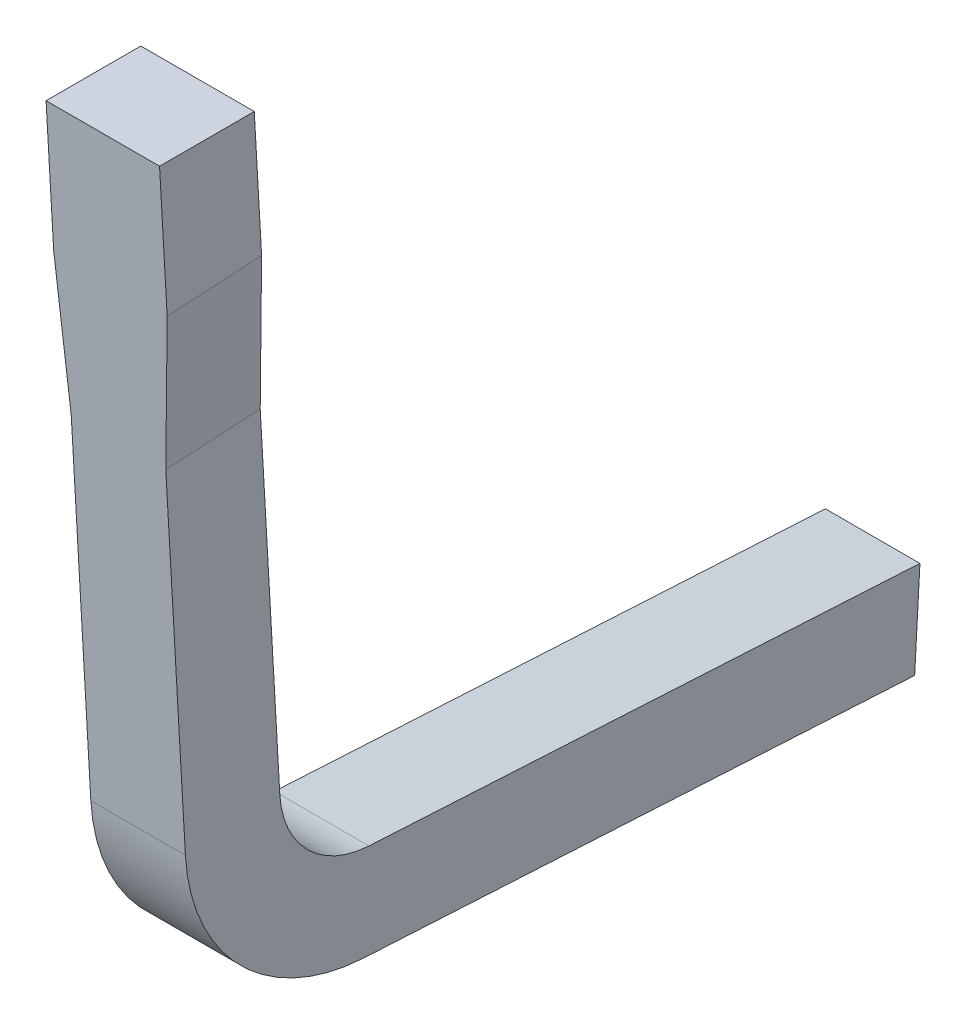
ISO-10303-21;
HEADER;
FILE_DESCRIPTION(('STEP AP214'),'2;1');
FILE_NAME('part.step','',(''),(''),'','','');
FILE_SCHEMA(('AUTOMOTIVE_DESIGN { 1 0 10303 214 1 1 1 1 }'));
ENDSEC;
DATA;
#1=APPLICATION_CONTEXT('core data for automotive mechanical design processes');
#2=APPLICATION_PROTOCOL_DEFINITION('international standard','automotive_design',2000,#1);
#3=PRODUCT_CONTEXT('',#1,'mechanical');
#4=PRODUCT('Part','Part','',(#3));
#5=PRODUCT_RELATED_PRODUCT_CATEGORY('part','',(#4));
#6=PRODUCT_DEFINITION_FORMATION('','',#4);
#7=PRODUCT_DEFINITION_CONTEXT('part definition',#1,'design');
#8=PRODUCT_DEFINITION('design','',#6,#7);
#9=PRODUCT_DEFINITION_SHAPE('','',#8);
#10=(LENGTH_UNIT() NAMED_UNIT(*) SI_UNIT(.MILLI.,.METRE.));
#11=(NAMED_UNIT(*) PLANE_ANGLE_UNIT() SI_UNIT($,.RADIAN.));
#12=(NAMED_UNIT(*) SI_UNIT($,.STERADIAN.) SOLID_ANGLE_UNIT());
#13=UNCERTAINTY_MEASURE_WITH_UNIT(LENGTH_MEASURE(1.E-05),#10,'distance_accuracy_value','');
#14=(GEOMETRIC_REPRESENTATION_CONTEXT(3) GLOBAL_UNCERTAINTY_ASSIGNED_CONTEXT((#13)) GLOBAL_UNIT_ASSIGNED_CONTEXT((#10,
#11,#12)) REPRESENTATION_CONTEXT('',''));
#15=CARTESIAN_POINT('',(0.,0.,0.));
#16=DIRECTION('',(0.,0.,1.));
#17=DIRECTION('',(1.,0.,0.));
#18=AXIS2_PLACEMENT_3D('',#15,#16,#17);
#19=CARTESIAN_POINT('',(0.88,-1.879082198882,-10.32387202233));
#20=DIRECTION('',(1.,0.,0.));
#21=DIRECTION('',(0.,0.,-1.));
#22=AXIS2_PLACEMENT_3D('',#19,#20,#21);
#23=PLANE('',#22);
#24=DIRECTION('',(1.7997756063594E-13,-0.0569406083160486,0.998377567418559));
#25=VECTOR('',#24,1.);
#26=CARTESIAN_POINT('',(0.879999999999996,-2.014836222708,-10.43177700759));
#27=LINE('',#26,#25);
#28=CARTESIAN_POINT('',(0.879999999999999,-2.01483622270796,-10.4317770075908));
#29=VERTEX_POINT('',#28);
#30=CARTESIAN_POINT('',(0.880000000000011,-2.02622434437119,-10.2321014941066));
#31=VERTEX_POINT('',#30);
#32=EDGE_CURVE('E183',#29,#31,#27,.T.);
#33=ORIENTED_EDGE('',*,*,#32,.T.);
#34=DIRECTION('',(0.,-0.998377567418999,-0.0569406083083299));
#35=VECTOR('',#34,1.);
#36=CARTESIAN_POINT('',(0.88,-2.398052209196,-10.25330800505));
#37=LINE('',#36,#35);
#38=CARTESIAN_POINT('',(0.88,-1.74332817505504,-10.2159670370689));
#39=VERTEX_POINT('',#38);
#40=EDGE_CURVE('E180',#39,#31,#37,.T.);
#41=ORIENTED_EDGE('',*,*,#40,.F.);
#42=DIRECTION('',(0.,0.,1.));
#43=VECTOR('',#42,1.);
#44=CARTESIAN_POINT('',(0.88,-1.743328175055,-10.31612954398));
#45=LINE('',#44,#43);
#46=CARTESIAN_POINT('',(0.88,-1.74332817505473,-10.4162920508947));
#47=VERTEX_POINT('',#46);
#48=EDGE_CURVE('E175',#47,#39,#45,.T.);
#49=ORIENTED_EDGE('',*,*,#48,.F.);
#50=DIRECTION('',(0.,-0.998377567418624,-0.0569406083148914));
#51=VECTOR('',#50,1.);
#52=CARTESIAN_POINT('',(0.88,-2.392358148368,-10.45330826871));
#53=LINE('',#52,#51);
#54=EDGE_CURVE('E205',#47,#29,#53,.T.);
#55=ORIENTED_EDGE('',*,*,#54,.T.);
#56=EDGE_LOOP('',(#33,#41,#49,#55));
#57=FACE_BOUND('',#56,.T.);
#58=ADVANCED_FACE('F17',(#57),#23,.F.);
#59=CARTESIAN_POINT('',(0.89,-2.170286918652,-10.3404803421));
#60=DIRECTION('',(0.997785157856611,0.0664110879137907,0.00378763292362404));
#61=DIRECTION('',(-0.0664115642910679,0.99779231512796,0.));
#62=AXIS2_PLACEMENT_3D('',#59,#60,#61);
#63=PLANE('',#62);
#64=DIRECTION('',(0.0665190105237393,-0.996166318707665,-0.0568144938493813));
#65=VECTOR('',#64,1.);
#66=CARTESIAN_POINT('',(0.88,-2.02622434437119,-10.2321014941066));
#67=LINE('',#66,#65);
#68=CARTESIAN_POINT('',(0.9,-2.32573761459706,-10.2491836765991));
#69=VERTEX_POINT('',#68);
#70=EDGE_CURVE('E161',#31,#69,#67,.T.);
#71=ORIENTED_EDGE('',*,*,#70,.F.);
#72=ORIENTED_EDGE('',*,*,#32,.F.);
#73=DIRECTION('',(0.0665190105237394,-0.996166318707292,-0.0568144938559241));
#74=VECTOR('',#73,1.);
#75=CARTESIAN_POINT('',(0.88,-2.01483622270793,-10.4317770075911));
#76=LINE('',#75,#74);
#77=CARTESIAN_POINT('',(0.9,-2.31434949293379,-10.4488591900838));
#78=VERTEX_POINT('',#77);
#79=EDGE_CURVE('E115',#29,#78,#76,.T.);
#80=ORIENTED_EDGE('',*,*,#79,.T.);
#81=DIRECTION('',(0.,-0.0569406083160594,0.998377567418558));
#82=VECTOR('',#81,1.);
#83=CARTESIAN_POINT('',(0.9,-2.314349492934,-10.44885919008));
#84=LINE('',#83,#82);
#85=EDGE_CURVE('E110',#78,#69,#84,.T.);
#86=ORIENTED_EDGE('',*,*,#85,.T.);
#87=EDGE_LOOP('',(#71,#72,#80,#86));
#88=FACE_BOUND('',#87,.T.);
#89=ADVANCED_FACE('F288',(#88),#63,.F.);
#90=CARTESIAN_POINT('',(1.12,-1.879082198882,-10.32387202233));
#91=DIRECTION('',(1.,0.,0.));
#92=DIRECTION('',(0.,0.,-1.));
#93=AXIS2_PLACEMENT_3D('',#90,#91,#92);
#94=PLANE('',#93);
#95=DIRECTION('',(0.,-0.998377567418624,-0.0569406083148914));
#96=VECTOR('',#95,1.);
#97=CARTESIAN_POINT('',(1.12,-2.392358148368,-10.45330826871));
#98=LINE('',#97,#96);
#99=CARTESIAN_POINT('',(1.12000000000002,-2.01483622270898,-10.4317770075904));
#100=VERTEX_POINT('',#99);
#101=CARTESIAN_POINT('',(1.12,-1.74332817505473,-10.4162920508947));
#102=VERTEX_POINT('',#101);
#103=EDGE_CURVE('E128',#100,#102,#98,.F.);
#104=ORIENTED_EDGE('',*,*,#103,.T.);
#105=DIRECTION('',(0.,0.,1.));
#106=VECTOR('',#105,1.);
#107=CARTESIAN_POINT('',(1.12,-1.743328175055,-10.31612954398));
#108=LINE('',#107,#106);
#109=CARTESIAN_POINT('',(1.12,-1.74332817505504,-10.2159670370692));
#110=VERTEX_POINT('',#109);
#111=EDGE_CURVE('E185',#110,#102,#108,.F.);
#112=ORIENTED_EDGE('',*,*,#111,.F.);
#113=DIRECTION('',(0.,-0.998377567418999,-0.0569406083083299));
#114=VECTOR('',#113,1.);
#115=CARTESIAN_POINT('',(1.12,-2.398052209196,-10.25330800505));
#116=LINE('',#115,#114);
#117=CARTESIAN_POINT('',(1.12000000000001,-2.02622434437119,-10.2321014941066));
#118=VERTEX_POINT('',#117);
#119=EDGE_CURVE('E168',#118,#110,#116,.F.);
#120=ORIENTED_EDGE('',*,*,#119,.F.);
#121=DIRECTION('',(0.,-0.0569406083110731,0.998377567418842));
#122=VECTOR('',#121,1.);
#123=CARTESIAN_POINT('',(1.12000000000003,-2.014836222709,-10.43177700759));
#124=LINE('',#123,#122);
#125=EDGE_CURVE('E131',#100,#118,#124,.T.);
#126=ORIENTED_EDGE('',*,*,#125,.F.);
#127=EDGE_LOOP('',(#104,#112,#120,#126));
#128=FACE_BOUND('',#127,.T.);
#129=ADVANCED_FACE('F251',(#128),#94,.T.);
#130=CARTESIAN_POINT('',(1.,-1.743328175055,-10.31612954398));
#131=DIRECTION('',(0.,1.,0.));
#132=DIRECTION('',(0.,0.,1.));
#133=AXIS2_PLACEMENT_3D('',#130,#131,#132);
#134=PLANE('',#133);
#135=DIRECTION('',(1.,0.,0.));
#136=VECTOR('',#135,1.);
#137=CARTESIAN_POINT('',(1.,-1.74332817505459,-10.4162920508971));
#138=LINE('',#137,#136);
#139=EDGE_CURVE('E138',#102,#47,#138,.F.);
#140=ORIENTED_EDGE('',*,*,#139,.T.);
#141=ORIENTED_EDGE('',*,*,#48,.T.);
#142=DIRECTION('',(1.,0.,0.));
#143=VECTOR('',#142,1.);
#144=CARTESIAN_POINT('',(1.,-1.74332817505506,-10.2159670370689));
#145=LINE('',#144,#143);
#146=EDGE_CURVE('E171',#110,#39,#145,.F.);
#147=ORIENTED_EDGE('',*,*,#146,.F.);
#148=ORIENTED_EDGE('',*,*,#111,.T.);
#149=EDGE_LOOP('',(#140,#141,#147,#148));
#150=FACE_BOUND('',#149,.T.);
#151=ADVANCED_FACE('F291',(#150),#134,.T.);
#152=CARTESIAN_POINT('',(0.9,-2.898875732105,-11.04167004462));
#153=DIRECTION('',(1.,0.,0.));
#154=DIRECTION('',(0.,0.,-1.));
#155=AXIS2_PLACEMENT_3D('',#152,#153,#154);
#156=PLANE('',#155);
#157=CARTESIAN_POINT('',(0.9,-3.03,-10.69));
#158=DIRECTION('',(-1.,0.,0.));
#159=DIRECTION('',(0.,0.,1.));
#160=AXIS2_PLACEMENT_3D('',#157,#158,#159);
#161=CIRCLE('',#160,0.4);
#162=CARTESIAN_POINT('',(0.9,-3.05277624332116,-10.2906489730313));
#163=VERTEX_POINT('',#162);
#164=CARTESIAN_POINT('',(0.9,-3.42937693582933,-10.6676826720305));
#165=VERTEX_POINT('',#164);
#166=EDGE_CURVE('E155',#163,#165,#161,.F.);
#167=ORIENTED_EDGE('',*,*,#166,.F.);
#168=DIRECTION('',(0.,-0.998377567418999,-0.0569406083083299));
#169=VECTOR('',#168,1.);
#170=CARTESIAN_POINT('',(0.9,-2.398052209196,-10.25330800505));
#171=LINE('',#170,#169);
#172=EDGE_CURVE('E158',#69,#163,#171,.T.);
#173=ORIENTED_EDGE('',*,*,#172,.F.);
#174=ORIENTED_EDGE('',*,*,#85,.F.);
#175=DIRECTION('',(0.,-0.998377567418624,-0.0569406083148914));
#176=VECTOR('',#175,1.);
#177=CARTESIAN_POINT('',(0.9,-2.392358148368,-10.45330826871));
#178=LINE('',#177,#176);
#179=CARTESIAN_POINT('',(0.9,-3.0413881216286,-10.4903244865199));
#180=VERTEX_POINT('',#179);
#181=EDGE_CURVE('E104',#78,#180,#178,.T.);
#182=ORIENTED_EDGE('',*,*,#181,.T.);
#183=CARTESIAN_POINT('',(0.9,-3.03,-10.69));
#184=DIRECTION('',(-1.,0.,0.));
#185=DIRECTION('',(0.,0.,1.));
#186=AXIS2_PLACEMENT_3D('',#183,#184,#185);
#187=CIRCLE('',#186,0.2);
#188=CARTESIAN_POINT('',(0.9,-3.22968846791482,-10.6788413360177));
#189=VERTEX_POINT('',#188);
#190=EDGE_CURVE('E20',#180,#189,#187,.F.);
#191=ORIENTED_EDGE('',*,*,#190,.T.);
#192=DIRECTION('',(0.,0.0557933199228295,0.998442339572991));
#193=VECTOR('',#192,1.);
#194=CARTESIAN_POINT('',(0.9,-3.262244863925,-11.26145022621));
#195=LINE('',#194,#193);
#196=CARTESIAN_POINT('',(0.9,-3.29480125993501,-11.8440591164004));
#197=VERTEX_POINT('',#196);
#198=EDGE_CURVE('E123',#197,#189,#195,.T.);
#199=ORIENTED_EDGE('',*,*,#198,.F.);
#200=DIRECTION('',(0.,-0.998442339574031,0.0557933199042218));
#201=VECTOR('',#200,1.);
#202=CARTESIAN_POINT('',(0.9,-3.394645493892,-11.83847978441));
#203=LINE('',#202,#201);
#204=CARTESIAN_POINT('',(0.9,-3.49448972784906,-11.8329004524196));
#205=VERTEX_POINT('',#204);
#206=EDGE_CURVE('E148',#197,#205,#203,.T.);
#207=ORIENTED_EDGE('',*,*,#206,.T.);
#208=DIRECTION('',(0.,0.055793319922371,0.998442339573017));
#209=VECTOR('',#208,1.);
#210=CARTESIAN_POINT('',(0.9,-3.461933331839,-11.25029156222));
#211=LINE('',#210,#209);
#212=EDGE_CURVE('E153',#205,#165,#211,.T.);
#213=ORIENTED_EDGE('',*,*,#212,.T.);
#214=EDGE_LOOP('',(#167,#173,#174,#182,#191,#199,#207,#213));
#215=FACE_BOUND('',#214,.T.);
#216=ADVANCED_FACE('F107',(#215),#156,.F.);
#217=CARTESIAN_POINT('',(1.,-3.262244863925,-11.26145022621));
#218=DIRECTION('',(0.,0.998442339572991,-0.0557933199228295));
#219=DIRECTION('',(0.,0.0557933199228295,0.998442339572991));
#220=AXIS2_PLACEMENT_3D('',#217,#218,#219);
#221=PLANE('',#220);
#222=DIRECTION('',(0.,0.055793319922887,0.998442339572988));
#223=VECTOR('',#222,1.);
#224=CARTESIAN_POINT('',(1.1,-3.294801259935,-11.8440591164));
#225=LINE('',#224,#223);
#226=CARTESIAN_POINT('',(1.1,-3.29480125993501,-11.8440591164001));
#227=VERTEX_POINT('',#226);
#228=CARTESIAN_POINT('',(1.1,-3.2296884679148,-10.6788413360177));
#229=VERTEX_POINT('',#228);
#230=EDGE_CURVE('E142',#227,#229,#225,.T.);
#231=ORIENTED_EDGE('',*,*,#230,.F.);
#232=DIRECTION('',(1.,0.,0.));
#233=VECTOR('',#232,1.);
#234=CARTESIAN_POINT('',(1.,-3.29480125993502,-11.8440591164004));
#235=LINE('',#234,#233);
#236=EDGE_CURVE('E139',#227,#197,#235,.F.);
#237=ORIENTED_EDGE('',*,*,#236,.T.);
#238=ORIENTED_EDGE('',*,*,#198,.T.);
#239=DIRECTION('',(-1.,0.,0.));
#240=VECTOR('',#239,1.);
#241=CARTESIAN_POINT('',(1.104,-3.22968846791485,-10.67884133602));
#242=LINE('',#241,#240);
#243=EDGE_CURVE('E122',#189,#229,#242,.F.);
#244=ORIENTED_EDGE('',*,*,#243,.T.);
#245=EDGE_LOOP('',(#231,#237,#238,#244));
#246=FACE_BOUND('',#245,.T.);
#247=ADVANCED_FACE('F284',(#246),#221,.T.);
#248=CARTESIAN_POINT('',(1.104,-3.03,-10.69));
#249=DIRECTION('',(-1.,0.,0.));
#250=DIRECTION('',(0.,0.,1.));
#251=AXIS2_PLACEMENT_3D('',#248,#249,#250);
#252=CYLINDRICAL_SURFACE('',#251,0.2);
#253=ORIENTED_EDGE('',*,*,#190,.F.);
#254=DIRECTION('',(1.,0.,0.));
#255=VECTOR('',#254,1.);
#256=CARTESIAN_POINT('',(1.,-3.04138812159455,-10.4903244865179));
#257=LINE('',#256,#255);
#258=CARTESIAN_POINT('',(1.1,-3.04138812162905,-10.4903244865184));
#259=VERTEX_POINT('',#258);
#260=EDGE_CURVE('E114',#180,#259,#257,.T.);
#261=ORIENTED_EDGE('',*,*,#260,.T.);
#262=CARTESIAN_POINT('',(1.1,-3.03,-10.69));
#263=DIRECTION('',(-1.,0.,0.));
#264=DIRECTION('',(0.,0.,1.));
#265=AXIS2_PLACEMENT_3D('',#262,#263,#264);
#266=CIRCLE('',#265,0.2);
#267=EDGE_CURVE('E223',#229,#259,#266,.T.);
#268=ORIENTED_EDGE('',*,*,#267,.F.);
#269=ORIENTED_EDGE('',*,*,#243,.F.);
#270=EDGE_LOOP('',(#253,#261,#268,#269));
#271=FACE_BOUND('',#270,.T.);
#272=ADVANCED_FACE('F119',(#271),#252,.F.);
#273=CARTESIAN_POINT('',(1.,-2.392358148368,-10.45330826871));
#274=DIRECTION('',(0.,-0.0569406083148914,0.998377567418624));
#275=DIRECTION('',(0.,-0.998377567418624,-0.0569406083148914));
#276=AXIS2_PLACEMENT_3D('',#273,#274,#275);
#277=PLANE('',#276);
#278=DIRECTION('',(0.0665190105240586,0.996166318708109,0.0568144938412267));
#279=VECTOR('',#278,1.);
#280=CARTESIAN_POINT('',(1.1,-2.314349492934,-10.44885919008));
#281=LINE('',#280,#279);
#282=CARTESIAN_POINT('',(1.1,-2.314349492934,-10.44885919008));
#283=VERTEX_POINT('',#282);
#284=EDGE_CURVE('E165',#283,#100,#281,.T.);
#285=ORIENTED_EDGE('',*,*,#284,.F.);
#286=DIRECTION('',(0.,0.998377567418421,0.0569406083184697));
#287=VECTOR('',#286,1.);
#288=CARTESIAN_POINT('',(1.1,-3.041388121684,-10.49032448652));
#289=LINE('',#288,#287);
#290=EDGE_CURVE('E126',#259,#283,#289,.T.);
#291=ORIENTED_EDGE('',*,*,#290,.F.);
#292=ORIENTED_EDGE('',*,*,#260,.F.);
#293=ORIENTED_EDGE('',*,*,#181,.F.);
#294=ORIENTED_EDGE('',*,*,#79,.F.);
#295=ORIENTED_EDGE('',*,*,#54,.F.);
#296=ORIENTED_EDGE('',*,*,#139,.F.);
#297=ORIENTED_EDGE('',*,*,#103,.F.);
#298=EDGE_LOOP('',(#285,#291,#292,#293,#294,#295,#296,#297));
#299=FACE_BOUND('',#298,.T.);
#300=ADVANCED_FACE('F124',(#299),#277,.F.);
#301=CARTESIAN_POINT('',(1.11,-2.170286918653,-10.34048034209));
#302=DIRECTION('',(0.99778515785659,-0.0664110879141193,-0.00378763292348296));
#303=DIRECTION('',(0.0664115642913965,0.997792315127938,0.));
#304=AXIS2_PLACEMENT_3D('',#301,#302,#303);
#305=PLANE('',#304);
#306=DIRECTION('',(0.,-0.0569406083160594,0.998377567418558));
#307=VECTOR('',#306,1.);
#308=CARTESIAN_POINT('',(1.1,-2.314349492934,-10.44885919008));
#309=LINE('',#308,#307);
#310=CARTESIAN_POINT('',(1.1,-2.32573761459702,-10.2491836765997));
#311=VERTEX_POINT('',#310);
#312=EDGE_CURVE('E238',#283,#311,#309,.T.);
#313=ORIENTED_EDGE('',*,*,#312,.F.);
#314=ORIENTED_EDGE('',*,*,#284,.T.);
#315=ORIENTED_EDGE('',*,*,#125,.T.);
#316=DIRECTION('',(0.0665190105237393,0.996166318707665,0.0568144938493813));
#317=VECTOR('',#316,1.);
#318=CARTESIAN_POINT('',(1.1,-2.32573761459705,-10.2491836765991));
#319=LINE('',#318,#317);
#320=EDGE_CURVE('E160',#311,#118,#319,.T.);
#321=ORIENTED_EDGE('',*,*,#320,.F.);
#322=EDGE_LOOP('',(#313,#314,#315,#321));
#323=FACE_BOUND('',#322,.T.);
#324=ADVANCED_FACE('F245',(#323),#305,.T.);
#325=CARTESIAN_POINT('',(1.,-2.398052209196,-10.25330800505));
#326=DIRECTION('',(0.,-0.0569406083083299,0.998377567418999));
#327=DIRECTION('',(0.,-0.998377567418999,-0.0569406083083299));
#328=AXIS2_PLACEMENT_3D('',#325,#326,#327);
#329=PLANE('',#328);
#330=ORIENTED_EDGE('',*,*,#119,.T.);
#331=ORIENTED_EDGE('',*,*,#146,.T.);
#332=ORIENTED_EDGE('',*,*,#40,.T.);
#333=ORIENTED_EDGE('',*,*,#70,.T.);
#334=ORIENTED_EDGE('',*,*,#172,.T.);
#335=DIRECTION('',(-1.,0.,0.));
#336=VECTOR('',#335,1.);
#337=CARTESIAN_POINT('',(1.104,-3.05277624331888,-10.2906489730321));
#338=LINE('',#337,#336);
#339=CARTESIAN_POINT('',(1.1,-3.05277624332089,-10.2906489730312));
#340=VERTEX_POINT('',#339);
#341=EDGE_CURVE('E198',#340,#163,#338,.T.);
#342=ORIENTED_EDGE('',*,*,#341,.F.);
#343=DIRECTION('',(0.,-0.998377567419076,-0.0569406083069694));
#344=VECTOR('',#343,1.);
#345=CARTESIAN_POINT('',(1.1,-2.325737614597,-10.2491836766));
#346=LINE('',#345,#344);
#347=EDGE_CURVE('E222',#311,#340,#346,.T.);
#348=ORIENTED_EDGE('',*,*,#347,.F.);
#349=ORIENTED_EDGE('',*,*,#320,.T.);
#350=EDGE_LOOP('',(#330,#331,#332,#333,#334,#342,#348,#349));
#351=FACE_BOUND('',#350,.T.);
#352=ADVANCED_FACE('F255',(#351),#329,.T.);
#353=CARTESIAN_POINT('',(1.104,-3.03,-10.69));
#354=DIRECTION('',(-1.,0.,0.));
#355=DIRECTION('',(0.,0.,1.));
#356=AXIS2_PLACEMENT_3D('',#353,#354,#355);
#357=CYLINDRICAL_SURFACE('',#356,0.4);
#358=DIRECTION('',(1.,0.,0.));
#359=VECTOR('',#358,1.);
#360=CARTESIAN_POINT('',(1.,-3.4293769358293,-10.66768267203));
#361=LINE('',#360,#359);
#362=CARTESIAN_POINT('',(1.1,-3.42937693582946,-10.6676826720306));
#363=VERTEX_POINT('',#362);
#364=EDGE_CURVE('E150',#165,#363,#361,.T.);
#365=ORIENTED_EDGE('',*,*,#364,.T.);
#366=CARTESIAN_POINT('',(1.1,-3.03,-10.69));
#367=DIRECTION('',(-1.,0.,0.));
#368=DIRECTION('',(0.,0.,1.));
#369=AXIS2_PLACEMENT_3D('',#366,#367,#368);
#370=CIRCLE('',#369,0.4);
#371=EDGE_CURVE('E219',#340,#363,#370,.F.);
#372=ORIENTED_EDGE('',*,*,#371,.F.);
#373=ORIENTED_EDGE('',*,*,#341,.T.);
#374=ORIENTED_EDGE('',*,*,#166,.T.);
#375=EDGE_LOOP('',(#365,#372,#373,#374));
#376=FACE_BOUND('',#375,.T.);
#377=ADVANCED_FACE('F273',(#376),#357,.T.);
#378=CARTESIAN_POINT('',(1.,-3.461933331839,-11.25029156222));
#379=DIRECTION('',(0.,0.998442339573017,-0.055793319922371));
#380=DIRECTION('',(0.,0.055793319922371,0.998442339573017));
#381=AXIS2_PLACEMENT_3D('',#378,#379,#380);
#382=PLANE('',#381);
#383=ORIENTED_EDGE('',*,*,#364,.F.);
#384=ORIENTED_EDGE('',*,*,#212,.F.);
#385=DIRECTION('',(1.,0.,0.));
#386=VECTOR('',#385,1.);
#387=CARTESIAN_POINT('',(1.,-3.49448972784898,-11.8329004524196));
#388=LINE('',#387,#386);
#389=CARTESIAN_POINT('',(1.1,-3.49448972784899,-11.8329004524199));
#390=VERTEX_POINT('',#389);
#391=EDGE_CURVE('E35',#205,#390,#388,.T.);
#392=ORIENTED_EDGE('',*,*,#391,.T.);
#393=DIRECTION('',(0.,-0.0557933199219327,-0.998442339573042));
#394=VECTOR('',#393,1.);
#395=CARTESIAN_POINT('',(1.1,-3.429376935829,-10.66768267202));
#396=LINE('',#395,#394);
#397=EDGE_CURVE('E26',#363,#390,#396,.T.);
#398=ORIENTED_EDGE('',*,*,#397,.F.);
#399=EDGE_LOOP('',(#383,#384,#392,#398));
#400=FACE_BOUND('',#399,.T.);
#401=ADVANCED_FACE('F274',(#400),#382,.F.);
#402=CARTESIAN_POINT('',(1.,-3.394645493892,-11.83847978441));
#403=DIRECTION('',(0.,0.0557933199042218,0.998442339574031));
#404=DIRECTION('',(0.,-0.998442339574031,0.0557933199042218));
#405=AXIS2_PLACEMENT_3D('',#402,#403,#404);
#406=PLANE('',#405);
#407=DIRECTION('',(0.,0.998442339574254,-0.0557933199002383));
#408=VECTOR('',#407,1.);
#409=CARTESIAN_POINT('',(1.1,-3.494489727849,-11.83290045242));
#410=LINE('',#409,#408);
#411=EDGE_CURVE('E11',#390,#227,#410,.T.);
#412=ORIENTED_EDGE('',*,*,#411,.F.);
#413=ORIENTED_EDGE('',*,*,#391,.F.);
#414=ORIENTED_EDGE('',*,*,#206,.F.);
#415=ORIENTED_EDGE('',*,*,#236,.F.);
#416=EDGE_LOOP('',(#412,#413,#414,#415));
#417=FACE_BOUND('',#416,.T.);
#418=ADVANCED_FACE('F281',(#417),#406,.F.);
#419=CARTESIAN_POINT('',(1.1,-2.909472777839,-11.05227927458));
#420=DIRECTION('',(1.,0.,0.));
#421=DIRECTION('',(0.,0.,-1.));
#422=AXIS2_PLACEMENT_3D('',#419,#420,#421);
#423=PLANE('',#422);
#424=ORIENTED_EDGE('',*,*,#397,.T.);
#425=ORIENTED_EDGE('',*,*,#411,.T.);
#426=ORIENTED_EDGE('',*,*,#230,.T.);
#427=ORIENTED_EDGE('',*,*,#267,.T.);
#428=ORIENTED_EDGE('',*,*,#290,.T.);
#429=ORIENTED_EDGE('',*,*,#312,.T.);
#430=ORIENTED_EDGE('',*,*,#347,.T.);
#431=ORIENTED_EDGE('',*,*,#371,.T.);
#432=EDGE_LOOP('',(#424,#425,#426,#427,#428,#429,#430,#431));
#433=FACE_BOUND('',#432,.T.);
#434=ADVANCED_FACE('F260',(#433),#423,.T.);
#435=CLOSED_SHELL('',(#58,#89,#129,#151,#216,#247,#272,#300,#324,#352,#377,#401,#418,#434));
#436=MANIFOLD_SOLID_BREP('B1',#435);
#437=ADVANCED_BREP_SHAPE_REPRESENTATION('',(#18,#436),#14);
#438=SHAPE_DEFINITION_REPRESENTATION(#9,#437);
ENDSEC;
END-ISO-10303-21;
